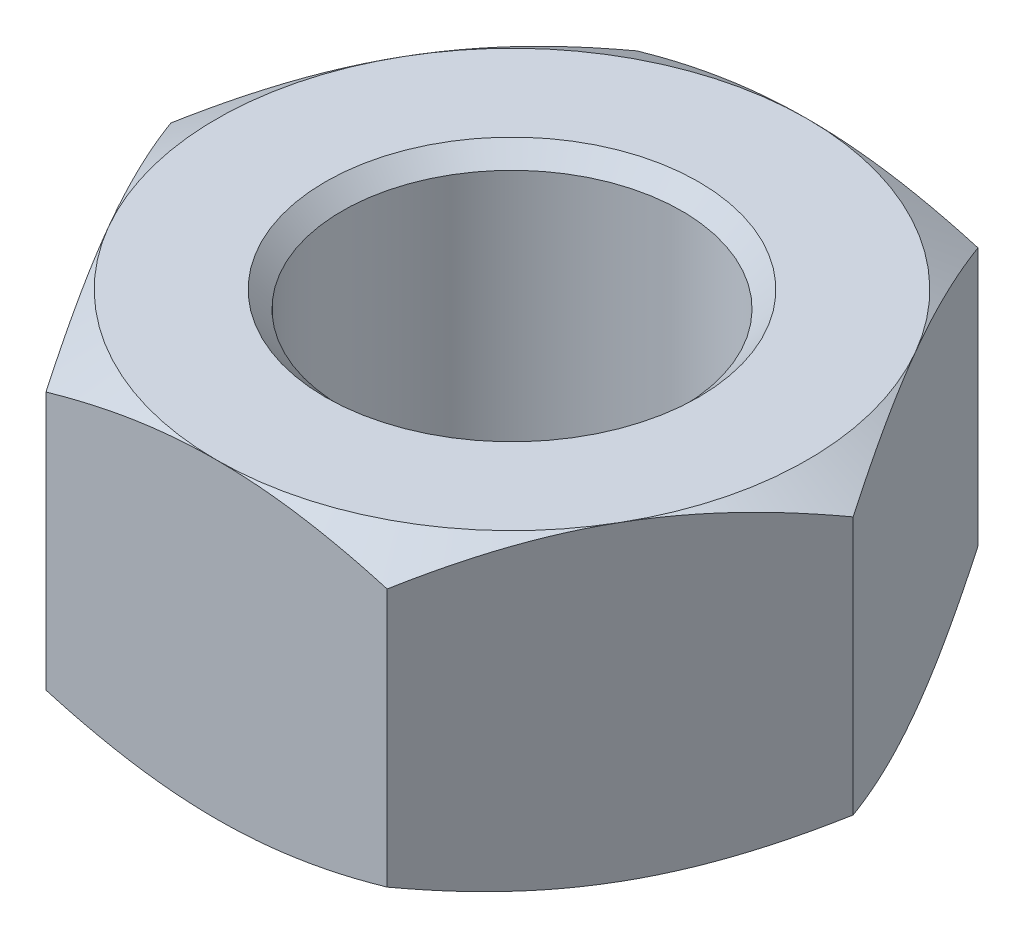
ISO-10303-21;
HEADER;
FILE_DESCRIPTION(('STEP AP214'),'2;1');
FILE_NAME('part.step','',(''),(''),'','','');
FILE_SCHEMA(('AUTOMOTIVE_DESIGN { 1 0 10303 214 1 1 1 1 }'));
ENDSEC;
DATA;
#1=APPLICATION_CONTEXT('core data for automotive mechanical design processes');
#2=APPLICATION_PROTOCOL_DEFINITION('international standard','automotive_design',2000,#1);
#3=PRODUCT_CONTEXT('',#1,'mechanical');
#4=PRODUCT('Part','Part','',(#3));
#5=PRODUCT_RELATED_PRODUCT_CATEGORY('part','',(#4));
#6=PRODUCT_DEFINITION_FORMATION('','',#4);
#7=PRODUCT_DEFINITION_CONTEXT('part definition',#1,'design');
#8=PRODUCT_DEFINITION('design','',#6,#7);
#9=PRODUCT_DEFINITION_SHAPE('','',#8);
#10=(LENGTH_UNIT() NAMED_UNIT(*) SI_UNIT(.MILLI.,.METRE.));
#11=(NAMED_UNIT(*) PLANE_ANGLE_UNIT() SI_UNIT($,.RADIAN.));
#12=(NAMED_UNIT(*) SI_UNIT($,.STERADIAN.) SOLID_ANGLE_UNIT());
#13=UNCERTAINTY_MEASURE_WITH_UNIT(LENGTH_MEASURE(1.E-05),#10,'distance_accuracy_value','');
#14=(GEOMETRIC_REPRESENTATION_CONTEXT(3) GLOBAL_UNCERTAINTY_ASSIGNED_CONTEXT((#13)) GLOBAL_UNIT_ASSIGNED_CONTEXT((#10,
#11,#12)) REPRESENTATION_CONTEXT('',''));
#15=CARTESIAN_POINT('',(0.,0.,0.));
#16=DIRECTION('',(0.,0.,1.));
#17=DIRECTION('',(1.,0.,0.));
#18=AXIS2_PLACEMENT_3D('',#15,#16,#17);
#19=CARTESIAN_POINT('',(55.2272413359522,-69.,-4.75));
#20=DIRECTION('',(0.866025403784439,0.,-0.5));
#21=DIRECTION('',(-0.5,0.,-0.866025403784439));
#22=AXIS2_PLACEMENT_3D('',#19,#20,#21);
#23=PLANE('',#22);
#24=CARTESIAN_POINT('',(52.4819837774524,-67.1498517286183,-9.50492557118405));
#25=CARTESIAN_POINT('',(53.9533399166947,-68.,-6.95646198198795));
#26=CARTESIAN_POINT('',(55.2272413359522,-68.,-4.75));
#27=CARTESIAN_POINT('',(56.5011427552097,-68.0000000000001,-2.54353801801205));
#28=CARTESIAN_POINT('',(57.9724988944519,-67.1498517286183,0.00492557118405202));
#29=(BOUNDED_CURVE() B_SPLINE_CURVE(2,(#24,#25,#26,#27,#28),.UNSPECIFIED.,.F.,
.F.) B_SPLINE_CURVE_WITH_KNOTS((3,2,3),(0.,5.57015057763849,11.140301155277),
.UNSPECIFIED.) CURVE() GEOMETRIC_REPRESENTATION_ITEM() RATIONAL_B_SPLINE_CURVE((1.,
1.03802697460132,1.,1.03802697460132,1.)) REPRESENTATION_ITEM(''));
#30=CARTESIAN_POINT('',(52.4848275573015,-67.1514942239681,-9.5));
#31=VERTEX_POINT('',#30);
#32=CARTESIAN_POINT('',(55.2272413359522,-68.,-4.75));
#33=VERTEX_POINT('',#32);
#34=EDGE_CURVE('E171',#31,#33,#29,.T.);
#35=ORIENTED_EDGE('',*,*,#34,.F.);
#36=DIRECTION('',(0.,1.,0.));
#37=VECTOR('',#36,1.);
#38=CARTESIAN_POINT('',(52.4848275573015,-69.,-9.5));
#39=LINE('',#38,#37);
#40=CARTESIAN_POINT('',(52.4848275573015,-58.8485057760319,-9.5));
#41=VERTEX_POINT('',#40);
#42=EDGE_CURVE('E10',#31,#41,#39,.T.);
#43=ORIENTED_EDGE('',*,*,#42,.T.);
#44=CARTESIAN_POINT('',(57.9724988944519,-58.8501482713817,0.00492557118405869));
#45=CARTESIAN_POINT('',(56.5011427552096,-58.,-2.54353801801204));
#46=CARTESIAN_POINT('',(55.2272413359522,-58.,-4.75));
#47=CARTESIAN_POINT('',(53.9533399166948,-58.,-6.95646198198795));
#48=CARTESIAN_POINT('',(52.4819837774524,-58.8501482713817,-9.50492557118406));
#49=(BOUNDED_CURVE() B_SPLINE_CURVE(2,(#44,#45,#46,#47,#48),.UNSPECIFIED.,.F.,
.F.) B_SPLINE_CURVE_WITH_KNOTS((3,2,3),(0.,5.57015057763849,11.140301155277),
.UNSPECIFIED.) CURVE() GEOMETRIC_REPRESENTATION_ITEM() RATIONAL_B_SPLINE_CURVE((1.,
1.03802697460132,1.,1.03802697460132,1.)) REPRESENTATION_ITEM(''));
#50=CARTESIAN_POINT('',(55.2272413359522,-58.,-4.75));
#51=VERTEX_POINT('',#50);
#52=EDGE_CURVE('E240',#51,#41,#49,.T.);
#53=ORIENTED_EDGE('',*,*,#52,.F.);
#54=CARTESIAN_POINT('',(57.9724988944519,-58.8501482713817,0.00492557118405869));
#55=CARTESIAN_POINT('',(56.5011427552096,-58.,-2.54353801801204));
#56=CARTESIAN_POINT('',(55.2272413359522,-58.,-4.75));
#57=CARTESIAN_POINT('',(53.9533399166948,-58.,-6.95646198198795));
#58=CARTESIAN_POINT('',(52.4819837774524,-58.8501482713817,-9.50492557118406));
#59=(BOUNDED_CURVE() B_SPLINE_CURVE(2,(#54,#55,#56,#57,#58),.UNSPECIFIED.,.F.,
.F.) B_SPLINE_CURVE_WITH_KNOTS((3,2,3),(0.,5.57015057763849,11.140301155277),
.UNSPECIFIED.) CURVE() GEOMETRIC_REPRESENTATION_ITEM() RATIONAL_B_SPLINE_CURVE((1.,
1.03802697460132,1.,1.03802697460132,1.)) REPRESENTATION_ITEM(''));
#60=CARTESIAN_POINT('',(57.9696551146029,-58.8485057760319,0.));
#61=VERTEX_POINT('',#60);
#62=EDGE_CURVE('E19',#61,#51,#59,.T.);
#63=ORIENTED_EDGE('',*,*,#62,.F.);
#64=DIRECTION('',(0.,1.,0.));
#65=VECTOR('',#64,1.);
#66=CARTESIAN_POINT('',(57.9696551146029,-69.,0.));
#67=LINE('',#66,#65);
#68=CARTESIAN_POINT('',(57.9696551146029,-67.1514942239681,0.));
#69=VERTEX_POINT('',#68);
#70=EDGE_CURVE('E267',#69,#61,#67,.T.);
#71=ORIENTED_EDGE('',*,*,#70,.F.);
#72=CARTESIAN_POINT('',(52.4819837774524,-67.1498517286183,-9.50492557118405));
#73=CARTESIAN_POINT('',(53.9533399166947,-68.,-6.95646198198795));
#74=CARTESIAN_POINT('',(55.2272413359522,-68.,-4.75));
#75=CARTESIAN_POINT('',(56.5011427552097,-68.0000000000001,-2.54353801801205));
#76=CARTESIAN_POINT('',(57.9724988944519,-67.1498517286183,0.00492557118405202));
#77=(BOUNDED_CURVE() B_SPLINE_CURVE(2,(#72,#73,#74,#75,#76),.UNSPECIFIED.,.F.,
.F.) B_SPLINE_CURVE_WITH_KNOTS((3,2,3),(0.,5.57015057763849,11.140301155277),
.UNSPECIFIED.) CURVE() GEOMETRIC_REPRESENTATION_ITEM() RATIONAL_B_SPLINE_CURVE((1.,
1.03802697460132,1.,1.03802697460132,1.)) REPRESENTATION_ITEM(''));
#78=EDGE_CURVE('E159',#33,#69,#77,.T.);
#79=ORIENTED_EDGE('',*,*,#78,.F.);
#80=EDGE_LOOP('',(#35,#43,#53,#63,#71,#79));
#81=FACE_BOUND('',#80,.T.);
#82=ADVANCED_FACE('F15',(#81),#23,.T.);
#83=CARTESIAN_POINT('',(47.,-69.,-9.5));
#84=DIRECTION('',(0.,0.,-1.));
#85=DIRECTION('',(-1.,0.,0.));
#86=AXIS2_PLACEMENT_3D('',#83,#84,#85);
#87=PLANE('',#86);
#88=CARTESIAN_POINT('',(41.5094848830005,-67.1498517286183,-9.5));
#89=CARTESIAN_POINT('',(44.4521971614852,-68.0000000000001,-9.50000000000001));
#90=CARTESIAN_POINT('',(47.,-68.,-9.5));
#91=CARTESIAN_POINT('',(49.5478028385149,-68.0000000000001,-9.50000000000001));
#92=CARTESIAN_POINT('',(52.4905151169995,-67.1498517286183,-9.5));
#93=(BOUNDED_CURVE() B_SPLINE_CURVE(2,(#88,#89,#90,#91,#92),.UNSPECIFIED.,.F.,
.F.) B_SPLINE_CURVE_WITH_KNOTS((3,2,3),(0.,5.57015057763849,11.140301155277),
.UNSPECIFIED.) CURVE() GEOMETRIC_REPRESENTATION_ITEM() RATIONAL_B_SPLINE_CURVE((1.,
1.03802697460134,1.,1.03802697460134,1.)) REPRESENTATION_ITEM(''));
#94=CARTESIAN_POINT('',(41.5151724426986,-67.1514942239681,-9.5));
#95=VERTEX_POINT('',#94);
#96=CARTESIAN_POINT('',(47.,-68.,-9.5));
#97=VERTEX_POINT('',#96);
#98=EDGE_CURVE('E189',#95,#97,#93,.T.);
#99=ORIENTED_EDGE('',*,*,#98,.F.);
#100=DIRECTION('',(0.,1.,0.));
#101=VECTOR('',#100,1.);
#102=CARTESIAN_POINT('',(41.5151724426986,-69.,-9.5));
#103=LINE('',#102,#101);
#104=CARTESIAN_POINT('',(41.5151724426986,-58.8485057760319,-9.5));
#105=VERTEX_POINT('',#104);
#106=EDGE_CURVE('E27',#95,#105,#103,.T.);
#107=ORIENTED_EDGE('',*,*,#106,.T.);
#108=CARTESIAN_POINT('',(52.4905151169995,-58.8501482713817,-9.5));
#109=CARTESIAN_POINT('',(49.5478028385149,-58.,-9.50000000000001));
#110=CARTESIAN_POINT('',(47.,-58.,-9.5));
#111=CARTESIAN_POINT('',(44.4521971614851,-58.,-9.50000000000001));
#112=CARTESIAN_POINT('',(41.5094848830005,-58.8501482713817,-9.5));
#113=(BOUNDED_CURVE() B_SPLINE_CURVE(2,(#108,#109,#110,#111,#112),.UNSPECIFIED.,.F.,
.F.) B_SPLINE_CURVE_WITH_KNOTS((3,2,3),(0.,5.5701505776385,11.140301155277),
.UNSPECIFIED.) CURVE() GEOMETRIC_REPRESENTATION_ITEM() RATIONAL_B_SPLINE_CURVE((1.,
1.03802697460132,1.,1.03802697460132,1.)) REPRESENTATION_ITEM(''));
#114=CARTESIAN_POINT('',(47.,-58.,-9.5));
#115=VERTEX_POINT('',#114);
#116=EDGE_CURVE('E184',#115,#105,#113,.T.);
#117=ORIENTED_EDGE('',*,*,#116,.F.);
#118=CARTESIAN_POINT('',(52.4905151169995,-58.8501482713817,-9.5));
#119=CARTESIAN_POINT('',(49.5478028385149,-58.,-9.50000000000001));
#120=CARTESIAN_POINT('',(47.,-58.,-9.5));
#121=CARTESIAN_POINT('',(44.4521971614851,-58.,-9.50000000000001));
#122=CARTESIAN_POINT('',(41.5094848830005,-58.8501482713817,-9.5));
#123=(BOUNDED_CURVE() B_SPLINE_CURVE(2,(#118,#119,#120,#121,#122),.UNSPECIFIED.,.F.,
.F.) B_SPLINE_CURVE_WITH_KNOTS((3,2,3),(0.,5.5701505776385,11.140301155277),
.UNSPECIFIED.) CURVE() GEOMETRIC_REPRESENTATION_ITEM() RATIONAL_B_SPLINE_CURVE((1.,
1.03802697460132,1.,1.03802697460132,1.)) REPRESENTATION_ITEM(''));
#124=EDGE_CURVE('E175',#41,#115,#123,.T.);
#125=ORIENTED_EDGE('',*,*,#124,.F.);
#126=ORIENTED_EDGE('',*,*,#42,.F.);
#127=CARTESIAN_POINT('',(41.5094848830005,-67.1498517286183,-9.5));
#128=CARTESIAN_POINT('',(44.4521971614852,-68.0000000000001,-9.50000000000001));
#129=CARTESIAN_POINT('',(47.,-68.,-9.5));
#130=CARTESIAN_POINT('',(49.5478028385149,-68.0000000000001,-9.50000000000001));
#131=CARTESIAN_POINT('',(52.4905151169995,-67.1498517286183,-9.5));
#132=(BOUNDED_CURVE() B_SPLINE_CURVE(2,(#127,#128,#129,#130,#131),.UNSPECIFIED.,.F.,
.F.) B_SPLINE_CURVE_WITH_KNOTS((3,2,3),(0.,5.57015057763849,11.140301155277),
.UNSPECIFIED.) CURVE() GEOMETRIC_REPRESENTATION_ITEM() RATIONAL_B_SPLINE_CURVE((1.,
1.03802697460134,1.,1.03802697460134,1.)) REPRESENTATION_ITEM(''));
#133=EDGE_CURVE('E216',#97,#31,#132,.T.);
#134=ORIENTED_EDGE('',*,*,#133,.F.);
#135=EDGE_LOOP('',(#99,#107,#117,#125,#126,#134));
#136=FACE_BOUND('',#135,.T.);
#137=ADVANCED_FACE('F367',(#136),#87,.T.);
#138=CARTESIAN_POINT('',(38.7727586640478,-69.,-4.75));
#139=DIRECTION('',(-0.866025403784439,0.,-0.5));
#140=DIRECTION('',(-0.5,0.,0.866025403784439));
#141=AXIS2_PLACEMENT_3D('',#138,#139,#140);
#142=PLANE('',#141);
#143=CARTESIAN_POINT('',(36.0275011055481,-67.1498517286183,0.00492557118405107));
#144=CARTESIAN_POINT('',(37.4988572447905,-68.0000000000001,-2.54353801801205));
#145=CARTESIAN_POINT('',(38.7727586640478,-68.,-4.75));
#146=CARTESIAN_POINT('',(40.0466600833053,-68.,-6.95646198198796));
#147=CARTESIAN_POINT('',(41.5180162225476,-67.1498517286183,-9.50492557118406));
#148=(BOUNDED_CURVE() B_SPLINE_CURVE(2,(#143,#144,#145,#146,#147),.UNSPECIFIED.,.F.,
.F.) B_SPLINE_CURVE_WITH_KNOTS((3,2,3),(0.,5.57015057763849,11.140301155277),
.UNSPECIFIED.) CURVE() GEOMETRIC_REPRESENTATION_ITEM() RATIONAL_B_SPLINE_CURVE((1.,
1.03802697460134,1.,1.03802697460135,1.)) REPRESENTATION_ITEM(''));
#149=CARTESIAN_POINT('',(36.0303448853971,-67.1514942239681,0.));
#150=VERTEX_POINT('',#149);
#151=CARTESIAN_POINT('',(38.7727586640478,-68.,-4.75));
#152=VERTEX_POINT('',#151);
#153=EDGE_CURVE('E135',#150,#152,#148,.T.);
#154=ORIENTED_EDGE('',*,*,#153,.F.);
#155=DIRECTION('',(0.,1.,0.));
#156=VECTOR('',#155,1.);
#157=CARTESIAN_POINT('',(36.0303448853971,-69.,0.));
#158=LINE('',#157,#156);
#159=CARTESIAN_POINT('',(36.0303448853971,-58.8485057760319,0.));
#160=VERTEX_POINT('',#159);
#161=EDGE_CURVE('E125',#150,#160,#158,.T.);
#162=ORIENTED_EDGE('',*,*,#161,.T.);
#163=CARTESIAN_POINT('',(41.5180162225476,-58.8501482713817,-9.50492557118407));
#164=CARTESIAN_POINT('',(40.0466600833053,-58.,-6.95646198198798));
#165=CARTESIAN_POINT('',(38.7727586640478,-58.,-4.75));
#166=CARTESIAN_POINT('',(37.4988572447904,-58.,-2.54353801801203));
#167=CARTESIAN_POINT('',(36.0275011055481,-58.8501482713817,0.00492557118405964));
#168=(BOUNDED_CURVE() B_SPLINE_CURVE(2,(#163,#164,#165,#166,#167),.UNSPECIFIED.,.F.,
.F.) B_SPLINE_CURVE_WITH_KNOTS((3,2,3),(0.,5.5701505776385,11.140301155277),
.UNSPECIFIED.) CURVE() GEOMETRIC_REPRESENTATION_ITEM() RATIONAL_B_SPLINE_CURVE((1.,
1.03802697460132,1.,1.03802697460132,1.)) REPRESENTATION_ITEM(''));
#169=CARTESIAN_POINT('',(38.7727586640478,-58.,-4.75));
#170=VERTEX_POINT('',#169);
#171=EDGE_CURVE('E196',#170,#160,#168,.T.);
#172=ORIENTED_EDGE('',*,*,#171,.F.);
#173=CARTESIAN_POINT('',(41.5180162225476,-58.8501482713817,-9.50492557118407));
#174=CARTESIAN_POINT('',(40.0466600833053,-58.,-6.95646198198798));
#175=CARTESIAN_POINT('',(38.7727586640478,-58.,-4.75));
#176=CARTESIAN_POINT('',(37.4988572447904,-58.,-2.54353801801203));
#177=CARTESIAN_POINT('',(36.0275011055481,-58.8501482713817,0.00492557118405964));
#178=(BOUNDED_CURVE() B_SPLINE_CURVE(2,(#173,#174,#175,#176,#177),.UNSPECIFIED.,.F.,
.F.) B_SPLINE_CURVE_WITH_KNOTS((3,2,3),(0.,5.5701505776385,11.140301155277),
.UNSPECIFIED.) CURVE() GEOMETRIC_REPRESENTATION_ITEM() RATIONAL_B_SPLINE_CURVE((1.,
1.03802697460132,1.,1.03802697460132,1.)) REPRESENTATION_ITEM(''));
#179=EDGE_CURVE('E179',#105,#170,#178,.T.);
#180=ORIENTED_EDGE('',*,*,#179,.F.);
#181=ORIENTED_EDGE('',*,*,#106,.F.);
#182=CARTESIAN_POINT('',(36.0275011055481,-67.1498517286183,0.00492557118405107));
#183=CARTESIAN_POINT('',(37.4988572447905,-68.0000000000001,-2.54353801801205));
#184=CARTESIAN_POINT('',(38.7727586640478,-68.,-4.75));
#185=CARTESIAN_POINT('',(40.0466600833053,-68.,-6.95646198198796));
#186=CARTESIAN_POINT('',(41.5180162225476,-67.1498517286183,-9.50492557118406));
#187=(BOUNDED_CURVE() B_SPLINE_CURVE(2,(#182,#183,#184,#185,#186),.UNSPECIFIED.,.F.,
.F.) B_SPLINE_CURVE_WITH_KNOTS((3,2,3),(0.,5.57015057763849,11.140301155277),
.UNSPECIFIED.) CURVE() GEOMETRIC_REPRESENTATION_ITEM() RATIONAL_B_SPLINE_CURVE((1.,
1.03802697460134,1.,1.03802697460135,1.)) REPRESENTATION_ITEM(''));
#188=EDGE_CURVE('E129',#152,#95,#187,.T.);
#189=ORIENTED_EDGE('',*,*,#188,.F.);
#190=EDGE_LOOP('',(#154,#162,#172,#180,#181,#189));
#191=FACE_BOUND('',#190,.T.);
#192=ADVANCED_FACE('F403',(#191),#142,.T.);
#193=CARTESIAN_POINT('',(55.2272413359522,-69.,4.75));
#194=DIRECTION('',(0.866025403784439,0.,0.5));
#195=DIRECTION('',(0.5,0.,-0.866025403784439));
#196=AXIS2_PLACEMENT_3D('',#193,#194,#195);
#197=PLANE('',#196);
#198=CARTESIAN_POINT('',(57.9724988944519,-67.1498517286183,-0.00492557118405583));
#199=CARTESIAN_POINT('',(56.5011427552096,-68.,2.54353801801203));
#200=CARTESIAN_POINT('',(55.2272413359522,-68.,4.75));
#201=CARTESIAN_POINT('',(53.9533399166947,-67.9999999999999,6.95646198198796));
#202=CARTESIAN_POINT('',(52.4819837774524,-67.1498517286183,9.50492557118405));
#203=(BOUNDED_CURVE() B_SPLINE_CURVE(2,(#198,#199,#200,#201,#202),.UNSPECIFIED.,.F.,
.F.) B_SPLINE_CURVE_WITH_KNOTS((3,2,3),(0.,5.57015057763849,11.140301155277),
.UNSPECIFIED.) CURVE() GEOMETRIC_REPRESENTATION_ITEM() RATIONAL_B_SPLINE_CURVE((1.,
1.03802697460133,1.,1.03802697460135,1.)) REPRESENTATION_ITEM(''));
#204=CARTESIAN_POINT('',(55.2272413359522,-68.,4.75));
#205=VERTEX_POINT('',#204);
#206=CARTESIAN_POINT('',(52.4848275573015,-67.1514942239681,9.5));
#207=VERTEX_POINT('',#206);
#208=EDGE_CURVE('E151',#205,#207,#203,.T.);
#209=ORIENTED_EDGE('',*,*,#208,.F.);
#210=CARTESIAN_POINT('',(57.9724988944519,-67.1498517286183,-0.00492557118405583));
#211=CARTESIAN_POINT('',(56.5011427552096,-68.,2.54353801801203));
#212=CARTESIAN_POINT('',(55.2272413359522,-68.,4.75));
#213=CARTESIAN_POINT('',(53.9533399166947,-67.9999999999999,6.95646198198796));
#214=CARTESIAN_POINT('',(52.4819837774524,-67.1498517286183,9.50492557118405));
#215=(BOUNDED_CURVE() B_SPLINE_CURVE(2,(#210,#211,#212,#213,#214),.UNSPECIFIED.,.F.,
.F.) B_SPLINE_CURVE_WITH_KNOTS((3,2,3),(0.,5.57015057763849,11.140301155277),
.UNSPECIFIED.) CURVE() GEOMETRIC_REPRESENTATION_ITEM() RATIONAL_B_SPLINE_CURVE((1.,
1.03802697460133,1.,1.03802697460135,1.)) REPRESENTATION_ITEM(''));
#216=EDGE_CURVE('E180',#69,#205,#215,.T.);
#217=ORIENTED_EDGE('',*,*,#216,.F.);
#218=ORIENTED_EDGE('',*,*,#70,.T.);
#219=CARTESIAN_POINT('',(52.4819837774524,-58.8501482713817,9.50492557118406));
#220=CARTESIAN_POINT('',(53.9533399166947,-58.,6.95646198198797));
#221=CARTESIAN_POINT('',(55.2272413359522,-58.,4.75));
#222=CARTESIAN_POINT('',(56.5011427552096,-58.,2.54353801801203));
#223=CARTESIAN_POINT('',(57.9724988944519,-58.8501482713817,-0.00492557118406345));
#224=(BOUNDED_CURVE() B_SPLINE_CURVE(2,(#219,#220,#221,#222,#223),.UNSPECIFIED.,.F.,
.F.) B_SPLINE_CURVE_WITH_KNOTS((3,2,3),(0.,5.5701505776385,11.140301155277),
.UNSPECIFIED.) CURVE() GEOMETRIC_REPRESENTATION_ITEM() RATIONAL_B_SPLINE_CURVE((1.,
1.03802697460133,1.,1.03802697460134,1.)) REPRESENTATION_ITEM(''));
#225=CARTESIAN_POINT('',(55.2272413359522,-58.,4.75));
#226=VERTEX_POINT('',#225);
#227=EDGE_CURVE('E259',#226,#61,#224,.T.);
#228=ORIENTED_EDGE('',*,*,#227,.F.);
#229=CARTESIAN_POINT('',(52.4819837774524,-58.8501482713817,9.50492557118406));
#230=CARTESIAN_POINT('',(53.9533399166947,-58.,6.95646198198797));
#231=CARTESIAN_POINT('',(55.2272413359522,-58.,4.75));
#232=CARTESIAN_POINT('',(56.5011427552096,-58.,2.54353801801203));
#233=CARTESIAN_POINT('',(57.9724988944519,-58.8501482713817,-0.00492557118406345));
#234=(BOUNDED_CURVE() B_SPLINE_CURVE(2,(#229,#230,#231,#232,#233),.UNSPECIFIED.,.F.,
.F.) B_SPLINE_CURVE_WITH_KNOTS((3,2,3),(0.,5.5701505776385,11.140301155277),
.UNSPECIFIED.) CURVE() GEOMETRIC_REPRESENTATION_ITEM() RATIONAL_B_SPLINE_CURVE((1.,
1.03802697460133,1.,1.03802697460134,1.)) REPRESENTATION_ITEM(''));
#235=CARTESIAN_POINT('',(52.4848275573015,-58.8485057760319,9.5));
#236=VERTEX_POINT('',#235);
#237=EDGE_CURVE('E202',#236,#226,#234,.T.);
#238=ORIENTED_EDGE('',*,*,#237,.F.);
#239=DIRECTION('',(0.,1.,0.));
#240=VECTOR('',#239,1.);
#241=CARTESIAN_POINT('',(52.4848275573015,-69.,9.5));
#242=LINE('',#241,#240);
#243=EDGE_CURVE('E226',#207,#236,#242,.T.);
#244=ORIENTED_EDGE('',*,*,#243,.F.);
#245=EDGE_LOOP('',(#209,#217,#218,#228,#238,#244));
#246=FACE_BOUND('',#245,.T.);
#247=ADVANCED_FACE('F376',(#246),#197,.T.);
#248=CARTESIAN_POINT('',(47.,-69.,9.5));
#249=DIRECTION('',(0.,0.,1.));
#250=DIRECTION('',(1.,0.,0.));
#251=AXIS2_PLACEMENT_3D('',#248,#249,#250);
#252=PLANE('',#251);
#253=CARTESIAN_POINT('',(52.4905151169995,-67.1498517286183,9.5));
#254=CARTESIAN_POINT('',(49.5478028385149,-68.0000000000001,9.5));
#255=CARTESIAN_POINT('',(47.,-68.,9.5));
#256=CARTESIAN_POINT('',(44.4521971614851,-68.,9.49999999999999));
#257=CARTESIAN_POINT('',(41.5094848830005,-67.1498517286183,9.5));
#258=(BOUNDED_CURVE() B_SPLINE_CURVE(2,(#253,#254,#255,#256,#257),.UNSPECIFIED.,.F.,
.F.) B_SPLINE_CURVE_WITH_KNOTS((3,2,3),(0.,5.5701505776385,11.140301155277),
.UNSPECIFIED.) CURVE() GEOMETRIC_REPRESENTATION_ITEM() RATIONAL_B_SPLINE_CURVE((1.,
1.03802697460134,1.,1.03802697460134,1.)) REPRESENTATION_ITEM(''));
#259=CARTESIAN_POINT('',(47.,-68.,9.5));
#260=VERTEX_POINT('',#259);
#261=CARTESIAN_POINT('',(41.5151724426986,-67.1514942239681,9.5));
#262=VERTEX_POINT('',#261);
#263=EDGE_CURVE('E148',#260,#262,#258,.T.);
#264=ORIENTED_EDGE('',*,*,#263,.F.);
#265=CARTESIAN_POINT('',(52.4905151169995,-67.1498517286183,9.5));
#266=CARTESIAN_POINT('',(49.5478028385149,-68.0000000000001,9.5));
#267=CARTESIAN_POINT('',(47.,-68.,9.5));
#268=CARTESIAN_POINT('',(44.4521971614851,-68.,9.49999999999999));
#269=CARTESIAN_POINT('',(41.5094848830005,-67.1498517286183,9.5));
#270=(BOUNDED_CURVE() B_SPLINE_CURVE(2,(#265,#266,#267,#268,#269),.UNSPECIFIED.,.F.,
.F.) B_SPLINE_CURVE_WITH_KNOTS((3,2,3),(0.,5.5701505776385,11.140301155277),
.UNSPECIFIED.) CURVE() GEOMETRIC_REPRESENTATION_ITEM() RATIONAL_B_SPLINE_CURVE((1.,
1.03802697460134,1.,1.03802697460134,1.)) REPRESENTATION_ITEM(''));
#271=EDGE_CURVE('E235',#207,#260,#270,.T.);
#272=ORIENTED_EDGE('',*,*,#271,.F.);
#273=ORIENTED_EDGE('',*,*,#243,.T.);
#274=CARTESIAN_POINT('',(41.5094848830005,-58.8501482713817,9.5));
#275=CARTESIAN_POINT('',(44.4521971614851,-58.,9.5));
#276=CARTESIAN_POINT('',(47.,-58.,9.5));
#277=CARTESIAN_POINT('',(49.5478028385148,-57.9999999999999,9.5));
#278=CARTESIAN_POINT('',(52.4905151169995,-58.8501482713817,9.5));
#279=(BOUNDED_CURVE() B_SPLINE_CURVE(2,(#274,#275,#276,#277,#278),.UNSPECIFIED.,.F.,
.F.) B_SPLINE_CURVE_WITH_KNOTS((3,2,3),(0.,5.5701505776385,11.140301155277),
.UNSPECIFIED.) CURVE() GEOMETRIC_REPRESENTATION_ITEM() RATIONAL_B_SPLINE_CURVE((1.,
1.03802697460136,1.,1.03802697460136,1.)) REPRESENTATION_ITEM(''));
#280=CARTESIAN_POINT('',(47.,-58.,9.5));
#281=VERTEX_POINT('',#280);
#282=EDGE_CURVE('E209',#281,#236,#279,.T.);
#283=ORIENTED_EDGE('',*,*,#282,.F.);
#284=CARTESIAN_POINT('',(41.5094848830005,-58.8501482713817,9.5));
#285=CARTESIAN_POINT('',(44.4521971614851,-58.,9.5));
#286=CARTESIAN_POINT('',(47.,-58.,9.5));
#287=CARTESIAN_POINT('',(49.5478028385148,-57.9999999999999,9.5));
#288=CARTESIAN_POINT('',(52.4905151169995,-58.8501482713817,9.5));
#289=(BOUNDED_CURVE() B_SPLINE_CURVE(2,(#284,#285,#286,#287,#288),.UNSPECIFIED.,.F.,
.F.) B_SPLINE_CURVE_WITH_KNOTS((3,2,3),(0.,5.5701505776385,11.140301155277),
.UNSPECIFIED.) CURVE() GEOMETRIC_REPRESENTATION_ITEM() RATIONAL_B_SPLINE_CURVE((1.,
1.03802697460136,1.,1.03802697460136,1.)) REPRESENTATION_ITEM(''));
#290=CARTESIAN_POINT('',(41.5151724426986,-58.8485057760319,9.5));
#291=VERTEX_POINT('',#290);
#292=EDGE_CURVE('E241',#291,#281,#289,.T.);
#293=ORIENTED_EDGE('',*,*,#292,.F.);
#294=DIRECTION('',(0.,1.,0.));
#295=VECTOR('',#294,1.);
#296=CARTESIAN_POINT('',(41.5151724426986,-69.,9.5));
#297=LINE('',#296,#295);
#298=EDGE_CURVE('E89',#262,#291,#297,.T.);
#299=ORIENTED_EDGE('',*,*,#298,.F.);
#300=EDGE_LOOP('',(#264,#272,#273,#283,#293,#299));
#301=FACE_BOUND('',#300,.T.);
#302=ADVANCED_FACE('F384',(#301),#252,.T.);
#303=CARTESIAN_POINT('',(38.7727586640478,-69.,4.75));
#304=DIRECTION('',(-0.866025403784439,0.,0.5));
#305=DIRECTION('',(0.5,0.,0.866025403784439));
#306=AXIS2_PLACEMENT_3D('',#303,#304,#305);
#307=PLANE('',#306);
#308=CARTESIAN_POINT('',(41.5180162225476,-67.1498517286183,9.50492557118405));
#309=CARTESIAN_POINT('',(40.0466600833053,-68.,6.95646198198795));
#310=CARTESIAN_POINT('',(38.7727586640478,-68.,4.75));
#311=CARTESIAN_POINT('',(37.4988572447904,-68.,2.54353801801204));
#312=CARTESIAN_POINT('',(36.0275011055481,-67.1498517286183,-0.00492557118405964));
#313=(BOUNDED_CURVE() B_SPLINE_CURVE(2,(#308,#309,#310,#311,#312),.UNSPECIFIED.,.F.,
.F.) B_SPLINE_CURVE_WITH_KNOTS((3,2,3),(0.,5.57015057763849,11.140301155277),
.UNSPECIFIED.) CURVE() GEOMETRIC_REPRESENTATION_ITEM() RATIONAL_B_SPLINE_CURVE((1.,
1.03802697460133,1.,1.03802697460134,1.)) REPRESENTATION_ITEM(''));
#314=CARTESIAN_POINT('',(38.7727586640478,-68.,4.75));
#315=VERTEX_POINT('',#314);
#316=EDGE_CURVE('E119',#315,#150,#313,.T.);
#317=ORIENTED_EDGE('',*,*,#316,.F.);
#318=CARTESIAN_POINT('',(41.5180162225476,-67.1498517286183,9.50492557118405));
#319=CARTESIAN_POINT('',(40.0466600833053,-68.,6.95646198198795));
#320=CARTESIAN_POINT('',(38.7727586640478,-68.,4.75));
#321=CARTESIAN_POINT('',(37.4988572447904,-68.,2.54353801801204));
#322=CARTESIAN_POINT('',(36.0275011055481,-67.1498517286183,-0.00492557118405964));
#323=(BOUNDED_CURVE() B_SPLINE_CURVE(2,(#318,#319,#320,#321,#322),.UNSPECIFIED.,.F.,
.F.) B_SPLINE_CURVE_WITH_KNOTS((3,2,3),(0.,5.57015057763849,11.140301155277),
.UNSPECIFIED.) CURVE() GEOMETRIC_REPRESENTATION_ITEM() RATIONAL_B_SPLINE_CURVE((1.,
1.03802697460133,1.,1.03802697460134,1.)) REPRESENTATION_ITEM(''));
#324=EDGE_CURVE('E123',#262,#315,#323,.T.);
#325=ORIENTED_EDGE('',*,*,#324,.F.);
#326=ORIENTED_EDGE('',*,*,#298,.T.);
#327=CARTESIAN_POINT('',(36.0275011055481,-58.8501482713817,-0.00492557118406345));
#328=CARTESIAN_POINT('',(37.4988572447904,-58.,2.54353801801203));
#329=CARTESIAN_POINT('',(38.7727586640478,-58.,4.75));
#330=CARTESIAN_POINT('',(40.0466600833052,-58.,6.95646198198796));
#331=CARTESIAN_POINT('',(41.5180162225476,-58.8501482713817,9.50492557118406));
#332=(BOUNDED_CURVE() B_SPLINE_CURVE(2,(#327,#328,#329,#330,#331),.UNSPECIFIED.,.F.,
.F.) B_SPLINE_CURVE_WITH_KNOTS((3,2,3),(0.,5.57015057763849,11.140301155277),
.UNSPECIFIED.) CURVE() GEOMETRIC_REPRESENTATION_ITEM() RATIONAL_B_SPLINE_CURVE((1.,
1.03802697460132,1.,1.03802697460134,1.)) REPRESENTATION_ITEM(''));
#333=CARTESIAN_POINT('',(38.7727586640478,-58.,4.75));
#334=VERTEX_POINT('',#333);
#335=EDGE_CURVE('E255',#334,#291,#332,.T.);
#336=ORIENTED_EDGE('',*,*,#335,.F.);
#337=CARTESIAN_POINT('',(36.0275011055481,-58.8501482713817,-0.00492557118406345));
#338=CARTESIAN_POINT('',(37.4988572447904,-58.,2.54353801801203));
#339=CARTESIAN_POINT('',(38.7727586640478,-58.,4.75));
#340=CARTESIAN_POINT('',(40.0466600833052,-58.,6.95646198198796));
#341=CARTESIAN_POINT('',(41.5180162225476,-58.8501482713817,9.50492557118406));
#342=(BOUNDED_CURVE() B_SPLINE_CURVE(2,(#337,#338,#339,#340,#341),.UNSPECIFIED.,.F.,
.F.) B_SPLINE_CURVE_WITH_KNOTS((3,2,3),(0.,5.57015057763849,11.140301155277),
.UNSPECIFIED.) CURVE() GEOMETRIC_REPRESENTATION_ITEM() RATIONAL_B_SPLINE_CURVE((1.,
1.03802697460132,1.,1.03802697460134,1.)) REPRESENTATION_ITEM(''));
#343=EDGE_CURVE('E197',#160,#334,#342,.T.);
#344=ORIENTED_EDGE('',*,*,#343,.F.);
#345=ORIENTED_EDGE('',*,*,#161,.F.);
#346=EDGE_LOOP('',(#317,#325,#326,#336,#344,#345));
#347=FACE_BOUND('',#346,.T.);
#348=ADVANCED_FACE('F121',(#347),#307,.T.);
#349=CARTESIAN_POINT('',(54.75,-68.,0.));
#350=DIRECTION('',(0.,-1.,0.));
#351=DIRECTION('',(-1.,0.,0.));
#352=AXIS2_PLACEMENT_3D('',#349,#350,#351);
#353=PLANE('',#352);
#354=CARTESIAN_POINT('',(47.,-68.,0.));
#355=DIRECTION('',(0.,1.,0.));
#356=DIRECTION('',(1.,0.,0.));
#357=AXIS2_PLACEMENT_3D('',#354,#355,#356);
#358=CIRCLE('',#357,6.);
#359=CARTESIAN_POINT('',(53.,-68.,0.));
#360=VERTEX_POINT('',#359);
#361=EDGE_CURVE('E34',#360,#360,#358,.T.);
#362=ORIENTED_EDGE('',*,*,#361,.T.);
#363=EDGE_LOOP('',(#362));
#364=FACE_BOUND('',#363,.T.);
#365=CARTESIAN_POINT('',(47.,-68.,0.));
#366=DIRECTION('',(0.,1.,0.));
#367=DIRECTION('',(1.,0.,0.));
#368=AXIS2_PLACEMENT_3D('',#365,#366,#367);
#369=CIRCLE('',#368,9.5);
#370=EDGE_CURVE('E176',#205,#33,#369,.T.);
#371=ORIENTED_EDGE('',*,*,#370,.F.);
#372=CARTESIAN_POINT('',(47.,-68.,0.));
#373=DIRECTION('',(0.,1.,0.));
#374=DIRECTION('',(1.,0.,0.));
#375=AXIS2_PLACEMENT_3D('',#372,#373,#374);
#376=CIRCLE('',#375,9.5);
#377=EDGE_CURVE('E144',#260,#205,#376,.T.);
#378=ORIENTED_EDGE('',*,*,#377,.F.);
#379=CARTESIAN_POINT('',(47.,-68.,0.));
#380=DIRECTION('',(0.,1.,0.));
#381=DIRECTION('',(1.,0.,0.));
#382=AXIS2_PLACEMENT_3D('',#379,#380,#381);
#383=CIRCLE('',#382,9.5);
#384=EDGE_CURVE('E141',#315,#260,#383,.T.);
#385=ORIENTED_EDGE('',*,*,#384,.F.);
#386=CARTESIAN_POINT('',(47.,-68.,0.));
#387=DIRECTION('',(0.,1.,0.));
#388=DIRECTION('',(1.,0.,0.));
#389=AXIS2_PLACEMENT_3D('',#386,#387,#388);
#390=CIRCLE('',#389,9.5);
#391=EDGE_CURVE('E130',#152,#315,#390,.T.);
#392=ORIENTED_EDGE('',*,*,#391,.F.);
#393=CARTESIAN_POINT('',(47.,-68.,0.));
#394=DIRECTION('',(0.,1.,0.));
#395=DIRECTION('',(1.,0.,0.));
#396=AXIS2_PLACEMENT_3D('',#393,#394,#395);
#397=CIRCLE('',#396,9.5);
#398=EDGE_CURVE('E221',#97,#152,#397,.T.);
#399=ORIENTED_EDGE('',*,*,#398,.F.);
#400=CARTESIAN_POINT('',(47.,-68.,0.));
#401=DIRECTION('',(0.,1.,0.));
#402=DIRECTION('',(1.,0.,0.));
#403=AXIS2_PLACEMENT_3D('',#400,#401,#402);
#404=CIRCLE('',#403,9.5);
#405=EDGE_CURVE('E169',#33,#97,#404,.T.);
#406=ORIENTED_EDGE('',*,*,#405,.F.);
#407=EDGE_LOOP('',(#371,#378,#385,#392,#399,#406));
#408=FACE_BOUND('',#407,.T.);
#409=ADVANCED_FACE('F142',(#364,#408),#353,.T.);
#410=CARTESIAN_POINT('',(47.,-67.729375,0.));
#411=DIRECTION('',(0.,-1.,0.));
#412=DIRECTION('',(1.,0.,0.));
#413=AXIS2_PLACEMENT_3D('',#410,#411,#412);
#414=CONICAL_SURFACE('',#413,5.729375,0.785398163397448);
#415=CARTESIAN_POINT('',(47.,-67.45875,0.));
#416=DIRECTION('',(0.,1.,0.));
#417=DIRECTION('',(1.,0.,0.));
#418=AXIS2_PLACEMENT_3D('',#415,#416,#417);
#419=CIRCLE('',#418,5.45875);
#420=CARTESIAN_POINT('',(52.45875,-67.45875,0.));
#421=VERTEX_POINT('',#420);
#422=EDGE_CURVE('E168',#421,#421,#419,.T.);
#423=ORIENTED_EDGE('',*,*,#422,.T.);
#424=EDGE_LOOP('',(#423));
#425=FACE_BOUND('',#424,.T.);
#426=ORIENTED_EDGE('',*,*,#361,.F.);
#427=EDGE_LOOP('',(#426));
#428=FACE_BOUND('',#427,.T.);
#429=ADVANCED_FACE('F426',(#425,#428),#414,.F.);
#430=CARTESIAN_POINT('',(47.,-63.,0.));
#431=DIRECTION('',(0.,-1.,0.));
#432=DIRECTION('',(1.,0.,0.));
#433=AXIS2_PLACEMENT_3D('',#430,#431,#432);
#434=CYLINDRICAL_SURFACE('',#433,5.45875);
#435=CARTESIAN_POINT('',(47.,-58.54125,0.));
#436=DIRECTION('',(0.,1.,0.));
#437=DIRECTION('',(1.,0.,0.));
#438=AXIS2_PLACEMENT_3D('',#435,#436,#437);
#439=CIRCLE('',#438,5.45875);
#440=CARTESIAN_POINT('',(52.45875,-58.54125,0.));
#441=VERTEX_POINT('',#440);
#442=EDGE_CURVE('E210',#441,#441,#439,.T.);
#443=ORIENTED_EDGE('',*,*,#442,.T.);
#444=EDGE_LOOP('',(#443));
#445=FACE_BOUND('',#444,.T.);
#446=ORIENTED_EDGE('',*,*,#422,.F.);
#447=EDGE_LOOP('',(#446));
#448=FACE_BOUND('',#447,.T.);
#449=ADVANCED_FACE('F429',(#445,#448),#434,.F.);
#450=CARTESIAN_POINT('',(47.,-58.270625,0.));
#451=DIRECTION('',(0.,1.,0.));
#452=DIRECTION('',(1.,0.,0.));
#453=AXIS2_PLACEMENT_3D('',#450,#451,#452);
#454=CONICAL_SURFACE('',#453,5.729375,0.785398163397448);
#455=CARTESIAN_POINT('',(47.,-58.,0.));
#456=DIRECTION('',(0.,1.,0.));
#457=DIRECTION('',(1.,0.,0.));
#458=AXIS2_PLACEMENT_3D('',#455,#456,#457);
#459=CIRCLE('',#458,6.);
#460=CARTESIAN_POINT('',(53.,-58.,0.));
#461=VERTEX_POINT('',#460);
#462=EDGE_CURVE('E174',#461,#461,#459,.T.);
#463=ORIENTED_EDGE('',*,*,#462,.T.);
#464=EDGE_LOOP('',(#463));
#465=FACE_BOUND('',#464,.T.);
#466=ORIENTED_EDGE('',*,*,#442,.F.);
#467=EDGE_LOOP('',(#466));
#468=FACE_BOUND('',#467,.T.);
#469=ADVANCED_FACE('F418',(#465,#468),#454,.F.);
#470=CARTESIAN_POINT('',(54.75,-58.,0.));
#471=DIRECTION('',(0.,1.,0.));
#472=DIRECTION('',(1.,0.,0.));
#473=AXIS2_PLACEMENT_3D('',#470,#471,#472);
#474=PLANE('',#473);
#475=CARTESIAN_POINT('',(47.,-58.,0.));
#476=DIRECTION('',(0.,1.,0.));
#477=DIRECTION('',(1.,0.,0.));
#478=AXIS2_PLACEMENT_3D('',#475,#476,#477);
#479=CIRCLE('',#478,9.5);
#480=EDGE_CURVE('E298',#226,#51,#479,.T.);
#481=ORIENTED_EDGE('',*,*,#480,.T.);
#482=CARTESIAN_POINT('',(47.,-58.,0.));
#483=DIRECTION('',(0.,1.,0.));
#484=DIRECTION('',(1.,0.,0.));
#485=AXIS2_PLACEMENT_3D('',#482,#483,#484);
#486=CIRCLE('',#485,9.5);
#487=EDGE_CURVE('E172',#51,#115,#486,.T.);
#488=ORIENTED_EDGE('',*,*,#487,.T.);
#489=CARTESIAN_POINT('',(47.,-58.,0.));
#490=DIRECTION('',(0.,1.,0.));
#491=DIRECTION('',(1.,0.,0.));
#492=AXIS2_PLACEMENT_3D('',#489,#490,#491);
#493=CIRCLE('',#492,9.5);
#494=EDGE_CURVE('E181',#115,#170,#493,.T.);
#495=ORIENTED_EDGE('',*,*,#494,.T.);
#496=CARTESIAN_POINT('',(47.,-58.,0.));
#497=DIRECTION('',(0.,1.,0.));
#498=DIRECTION('',(1.,0.,0.));
#499=AXIS2_PLACEMENT_3D('',#496,#497,#498);
#500=CIRCLE('',#499,9.5);
#501=EDGE_CURVE('E190',#170,#334,#500,.T.);
#502=ORIENTED_EDGE('',*,*,#501,.T.);
#503=CARTESIAN_POINT('',(47.,-58.,0.));
#504=DIRECTION('',(0.,1.,0.));
#505=DIRECTION('',(1.,0.,0.));
#506=AXIS2_PLACEMENT_3D('',#503,#504,#505);
#507=CIRCLE('',#506,9.5);
#508=EDGE_CURVE('E249',#334,#281,#507,.T.);
#509=ORIENTED_EDGE('',*,*,#508,.T.);
#510=CARTESIAN_POINT('',(47.,-58.,0.));
#511=DIRECTION('',(0.,1.,0.));
#512=DIRECTION('',(1.,0.,0.));
#513=AXIS2_PLACEMENT_3D('',#510,#511,#512);
#514=CIRCLE('',#513,9.5);
#515=EDGE_CURVE('E82',#281,#226,#514,.T.);
#516=ORIENTED_EDGE('',*,*,#515,.T.);
#517=EDGE_LOOP('',(#481,#488,#495,#502,#509,#516));
#518=FACE_BOUND('',#517,.T.);
#519=ORIENTED_EDGE('',*,*,#462,.F.);
#520=EDGE_LOOP('',(#519));
#521=FACE_BOUND('',#520,.T.);
#522=ADVANCED_FACE('F378',(#518,#521),#474,.T.);
#523=CARTESIAN_POINT('',(47.,-58.4250741356909,0.));
#524=DIRECTION('',(0.,-1.,0.));
#525=DIRECTION('',(1.,0.,0.));
#526=AXIS2_PLACEMENT_3D('',#523,#524,#525);
#527=CONICAL_SURFACE('',#526,10.23625,1.0471975511966);
#528=ORIENTED_EDGE('',*,*,#52,.T.);
#529=ORIENTED_EDGE('',*,*,#124,.T.);
#530=ORIENTED_EDGE('',*,*,#487,.F.);
#531=EDGE_LOOP('',(#528,#529,#530));
#532=FACE_BOUND('',#531,.T.);
#533=ADVANCED_FACE('F370',(#532),#527,.T.);
#534=CARTESIAN_POINT('',(47.,-58.4250741356909,0.));
#535=DIRECTION('',(0.,-1.,0.));
#536=DIRECTION('',(1.,0.,0.));
#537=AXIS2_PLACEMENT_3D('',#534,#535,#536);
#538=CONICAL_SURFACE('',#537,10.23625,1.0471975511966);
#539=ORIENTED_EDGE('',*,*,#227,.T.);
#540=ORIENTED_EDGE('',*,*,#62,.T.);
#541=ORIENTED_EDGE('',*,*,#480,.F.);
#542=EDGE_LOOP('',(#539,#540,#541));
#543=FACE_BOUND('',#542,.T.);
#544=ADVANCED_FACE('F17',(#543),#538,.T.);
#545=CARTESIAN_POINT('',(47.,-58.4250741356909,0.));
#546=DIRECTION('',(0.,-1.,0.));
#547=DIRECTION('',(1.,0.,0.));
#548=AXIS2_PLACEMENT_3D('',#545,#546,#547);
#549=CONICAL_SURFACE('',#548,10.23625,1.0471975511966);
#550=ORIENTED_EDGE('',*,*,#282,.T.);
#551=ORIENTED_EDGE('',*,*,#237,.T.);
#552=ORIENTED_EDGE('',*,*,#515,.F.);
#553=EDGE_LOOP('',(#550,#551,#552));
#554=FACE_BOUND('',#553,.T.);
#555=ADVANCED_FACE('F381',(#554),#549,.T.);
#556=CARTESIAN_POINT('',(47.,-58.4250741356909,0.));
#557=DIRECTION('',(0.,-1.,0.));
#558=DIRECTION('',(1.,0.,0.));
#559=AXIS2_PLACEMENT_3D('',#556,#557,#558);
#560=CONICAL_SURFACE('',#559,10.23625,1.0471975511966);
#561=ORIENTED_EDGE('',*,*,#292,.T.);
#562=ORIENTED_EDGE('',*,*,#508,.F.);
#563=ORIENTED_EDGE('',*,*,#335,.T.);
#564=EDGE_LOOP('',(#561,#562,#563));
#565=FACE_BOUND('',#564,.T.);
#566=ADVANCED_FACE('F400',(#565),#560,.T.);
#567=CARTESIAN_POINT('',(47.,-58.4250741356909,0.));
#568=DIRECTION('',(0.,-1.,0.));
#569=DIRECTION('',(1.,0.,0.));
#570=AXIS2_PLACEMENT_3D('',#567,#568,#569);
#571=CONICAL_SURFACE('',#570,10.23625,1.0471975511966);
#572=ORIENTED_EDGE('',*,*,#343,.T.);
#573=ORIENTED_EDGE('',*,*,#501,.F.);
#574=ORIENTED_EDGE('',*,*,#171,.T.);
#575=EDGE_LOOP('',(#572,#573,#574));
#576=FACE_BOUND('',#575,.T.);
#577=ADVANCED_FACE('F396',(#576),#571,.T.);
#578=CARTESIAN_POINT('',(47.,-58.4250741356909,0.));
#579=DIRECTION('',(0.,-1.,0.));
#580=DIRECTION('',(1.,0.,0.));
#581=AXIS2_PLACEMENT_3D('',#578,#579,#580);
#582=CONICAL_SURFACE('',#581,10.23625,1.0471975511966);
#583=ORIENTED_EDGE('',*,*,#179,.T.);
#584=ORIENTED_EDGE('',*,*,#494,.F.);
#585=ORIENTED_EDGE('',*,*,#116,.T.);
#586=EDGE_LOOP('',(#583,#584,#585));
#587=FACE_BOUND('',#586,.T.);
#588=ADVANCED_FACE('F402',(#587),#582,.T.);
#589=CARTESIAN_POINT('',(47.,-67.5749258643091,0.));
#590=DIRECTION('',(0.,1.,0.));
#591=DIRECTION('',(1.,0.,0.));
#592=AXIS2_PLACEMENT_3D('',#589,#590,#591);
#593=CONICAL_SURFACE('',#592,10.23625,1.0471975511966);
#594=ORIENTED_EDGE('',*,*,#78,.T.);
#595=ORIENTED_EDGE('',*,*,#216,.T.);
#596=ORIENTED_EDGE('',*,*,#370,.T.);
#597=EDGE_LOOP('',(#594,#595,#596));
#598=FACE_BOUND('',#597,.T.);
#599=ADVANCED_FACE('F431',(#598),#593,.T.);
#600=CARTESIAN_POINT('',(47.,-67.5749258643091,0.));
#601=DIRECTION('',(0.,1.,0.));
#602=DIRECTION('',(1.,0.,0.));
#603=AXIS2_PLACEMENT_3D('',#600,#601,#602);
#604=CONICAL_SURFACE('',#603,10.23625,1.0471975511966);
#605=ORIENTED_EDGE('',*,*,#133,.T.);
#606=ORIENTED_EDGE('',*,*,#34,.T.);
#607=ORIENTED_EDGE('',*,*,#405,.T.);
#608=EDGE_LOOP('',(#605,#606,#607));
#609=FACE_BOUND('',#608,.T.);
#610=ADVANCED_FACE('F351',(#609),#604,.T.);
#611=CARTESIAN_POINT('',(47.,-67.5749258643091,0.));
#612=DIRECTION('',(0.,1.,0.));
#613=DIRECTION('',(1.,0.,0.));
#614=AXIS2_PLACEMENT_3D('',#611,#612,#613);
#615=CONICAL_SURFACE('',#614,10.23625,1.0471975511966);
#616=ORIENTED_EDGE('',*,*,#188,.T.);
#617=ORIENTED_EDGE('',*,*,#98,.T.);
#618=ORIENTED_EDGE('',*,*,#398,.T.);
#619=EDGE_LOOP('',(#616,#617,#618));
#620=FACE_BOUND('',#619,.T.);
#621=ADVANCED_FACE('F365',(#620),#615,.T.);
#622=CARTESIAN_POINT('',(47.,-67.5749258643091,0.));
#623=DIRECTION('',(0.,1.,0.));
#624=DIRECTION('',(1.,0.,0.));
#625=AXIS2_PLACEMENT_3D('',#622,#623,#624);
#626=CONICAL_SURFACE('',#625,10.23625,1.0471975511966);
#627=ORIENTED_EDGE('',*,*,#153,.T.);
#628=ORIENTED_EDGE('',*,*,#391,.T.);
#629=ORIENTED_EDGE('',*,*,#316,.T.);
#630=EDGE_LOOP('',(#627,#628,#629));
#631=FACE_BOUND('',#630,.T.);
#632=ADVANCED_FACE('F134',(#631),#626,.T.);
#633=CARTESIAN_POINT('',(47.,-67.5749258643091,0.));
#634=DIRECTION('',(0.,1.,0.));
#635=DIRECTION('',(1.,0.,0.));
#636=AXIS2_PLACEMENT_3D('',#633,#634,#635);
#637=CONICAL_SURFACE('',#636,10.23625,1.0471975511966);
#638=ORIENTED_EDGE('',*,*,#324,.T.);
#639=ORIENTED_EDGE('',*,*,#384,.T.);
#640=ORIENTED_EDGE('',*,*,#263,.T.);
#641=EDGE_LOOP('',(#638,#639,#640));
#642=FACE_BOUND('',#641,.T.);
#643=ADVANCED_FACE('F150',(#642),#637,.T.);
#644=CARTESIAN_POINT('',(47.,-67.5749258643091,0.));
#645=DIRECTION('',(0.,1.,0.));
#646=DIRECTION('',(1.,0.,0.));
#647=AXIS2_PLACEMENT_3D('',#644,#645,#646);
#648=CONICAL_SURFACE('',#647,10.23625,1.0471975511966);
#649=ORIENTED_EDGE('',*,*,#271,.T.);
#650=ORIENTED_EDGE('',*,*,#377,.T.);
#651=ORIENTED_EDGE('',*,*,#208,.T.);
#652=EDGE_LOOP('',(#649,#650,#651));
#653=FACE_BOUND('',#652,.T.);
#654=ADVANCED_FACE('F438',(#653),#648,.T.);
#655=CLOSED_SHELL('',(#82,#137,#192,#247,#302,#348,#409,#429,#449,#469,#522,#533,#544,#555,#566,
#577,#588,#599,#610,#621,#632,#643,#654));
#656=MANIFOLD_SOLID_BREP('B1',#655);
#657=ADVANCED_BREP_SHAPE_REPRESENTATION('',(#18,#656),#14);
#658=SHAPE_DEFINITION_REPRESENTATION(#9,#657);
ENDSEC;
END-ISO-10303-21;
